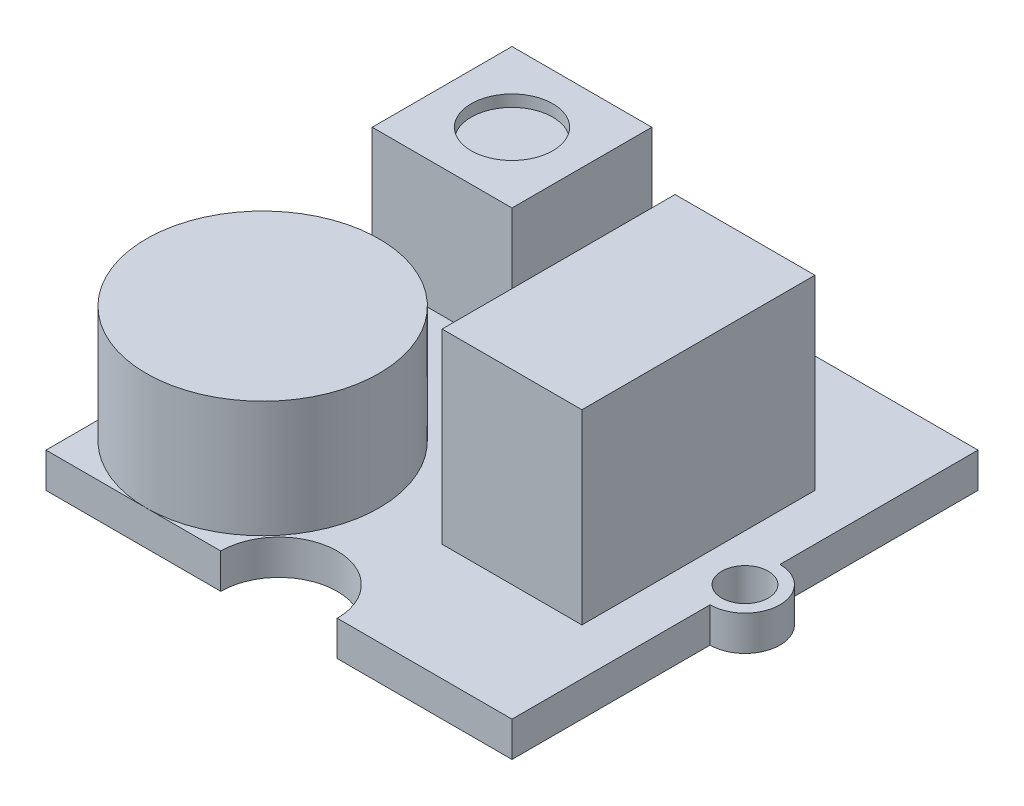
ISO-10303-21;
HEADER;
FILE_DESCRIPTION(('STEP AP214'),'2;1');
FILE_NAME('part.step','',(''),(''),'','','');
FILE_SCHEMA(('AUTOMOTIVE_DESIGN { 1 0 10303 214 1 1 1 1 }'));
ENDSEC;
DATA;
#1=APPLICATION_CONTEXT('core data for automotive mechanical design processes');
#2=APPLICATION_PROTOCOL_DEFINITION('international standard','automotive_design',2000,#1);
#3=PRODUCT_CONTEXT('',#1,'mechanical');
#4=PRODUCT('Part','Part','',(#3));
#5=PRODUCT_RELATED_PRODUCT_CATEGORY('part','',(#4));
#6=PRODUCT_DEFINITION_FORMATION('','',#4);
#7=PRODUCT_DEFINITION_CONTEXT('part definition',#1,'design');
#8=PRODUCT_DEFINITION('design','',#6,#7);
#9=PRODUCT_DEFINITION_SHAPE('','',#8);
#10=(LENGTH_UNIT() NAMED_UNIT(*) SI_UNIT(.MILLI.,.METRE.));
#11=(NAMED_UNIT(*) PLANE_ANGLE_UNIT() SI_UNIT($,.RADIAN.));
#12=(NAMED_UNIT(*) SI_UNIT($,.STERADIAN.) SOLID_ANGLE_UNIT());
#13=UNCERTAINTY_MEASURE_WITH_UNIT(LENGTH_MEASURE(1.E-05),#10,'distance_accuracy_value','');
#14=(GEOMETRIC_REPRESENTATION_CONTEXT(3) GLOBAL_UNCERTAINTY_ASSIGNED_CONTEXT((#13)) GLOBAL_UNIT_ASSIGNED_CONTEXT((#10,
#11,#12)) REPRESENTATION_CONTEXT('',''));
#15=CARTESIAN_POINT('',(0.,0.,0.));
#16=DIRECTION('',(0.,0.,1.));
#17=DIRECTION('',(1.,0.,0.));
#18=AXIS2_PLACEMENT_3D('',#15,#16,#17);
#19=CARTESIAN_POINT('',(0.,1.5,0.));
#20=DIRECTION('',(0.,1.,0.));
#21=DIRECTION('',(0.,0.,1.));
#22=AXIS2_PLACEMENT_3D('',#19,#20,#21);
#23=PLANE('',#22);
#24=CARTESIAN_POINT('',(-5.7,1.5,5.));
#25=DIRECTION('',(0.,1.,0.));
#26=DIRECTION('',(0.,0.,1.));
#27=AXIS2_PLACEMENT_3D('',#24,#25,#26);
#28=CIRCLE('',#27,5.);
#29=CARTESIAN_POINT('',(-5.7,1.5,10.));
#30=VERTEX_POINT('',#29);
#31=CARTESIAN_POINT('',(-10.,1.5,2.44852983556538));
#32=VERTEX_POINT('',#31);
#33=EDGE_CURVE('E44',#30,#32,#28,.T.);
#34=ORIENTED_EDGE('',*,*,#33,.F.);
#35=DIRECTION('',(1.,0.,0.));
#36=VECTOR('',#35,1.);
#37=CARTESIAN_POINT('',(-10.,1.5,10.));
#38=LINE('',#37,#36);
#39=CARTESIAN_POINT('',(-2.5,1.5,10.));
#40=VERTEX_POINT('',#39);
#41=EDGE_CURVE('E367',#30,#40,#38,.T.);
#42=ORIENTED_EDGE('',*,*,#41,.T.);
#43=CARTESIAN_POINT('',(0.,1.5,10.));
#44=DIRECTION('',(0.,1.,0.));
#45=DIRECTION('',(0.,0.,1.));
#46=AXIS2_PLACEMENT_3D('',#43,#44,#45);
#47=CIRCLE('',#46,2.5);
#48=CARTESIAN_POINT('',(2.5,1.5,10.));
#49=VERTEX_POINT('',#48);
#50=EDGE_CURVE('E295',#49,#40,#47,.T.);
#51=ORIENTED_EDGE('',*,*,#50,.F.);
#52=CARTESIAN_POINT('',(10.,1.5,10.));
#53=VERTEX_POINT('',#52);
#54=EDGE_CURVE('E362',#49,#53,#38,.T.);
#55=ORIENTED_EDGE('',*,*,#54,.T.);
#56=DIRECTION('',(0.,0.,-1.));
#57=VECTOR('',#56,1.);
#58=CARTESIAN_POINT('',(10.,1.5,-10.));
#59=LINE('',#58,#57);
#60=CARTESIAN_POINT('',(10.,1.5,1.5));
#61=VERTEX_POINT('',#60);
#62=EDGE_CURVE('E350',#53,#61,#59,.T.);
#63=ORIENTED_EDGE('',*,*,#62,.T.);
#64=CARTESIAN_POINT('',(10.,1.5,0.));
#65=DIRECTION('',(0.,1.,0.));
#66=DIRECTION('',(0.,0.,1.));
#67=AXIS2_PLACEMENT_3D('',#64,#65,#66);
#68=CIRCLE('',#67,1.5);
#69=CARTESIAN_POINT('',(10.,1.5,-1.5));
#70=VERTEX_POINT('',#69);
#71=EDGE_CURVE('E327',#61,#70,#68,.T.);
#72=ORIENTED_EDGE('',*,*,#71,.T.);
#73=CARTESIAN_POINT('',(10.,1.5,-10.));
#74=VERTEX_POINT('',#73);
#75=EDGE_CURVE('E354',#70,#74,#59,.T.);
#76=ORIENTED_EDGE('',*,*,#75,.T.);
#77=DIRECTION('',(-1.,0.,0.));
#78=VECTOR('',#77,1.);
#79=CARTESIAN_POINT('',(-10.,1.5,-10.));
#80=LINE('',#79,#78);
#81=CARTESIAN_POINT('',(2.5,1.5,-10.));
#82=VERTEX_POINT('',#81);
#83=EDGE_CURVE('E355',#74,#82,#80,.T.);
#84=ORIENTED_EDGE('',*,*,#83,.T.);
#85=CARTESIAN_POINT('',(0.,1.5,-10.));
#86=DIRECTION('',(0.,1.,0.));
#87=DIRECTION('',(0.,0.,1.));
#88=AXIS2_PLACEMENT_3D('',#85,#86,#87);
#89=CIRCLE('',#88,2.5);
#90=CARTESIAN_POINT('',(-2.5,1.5,-10.));
#91=VERTEX_POINT('',#90);
#92=EDGE_CURVE('E309',#91,#82,#89,.T.);
#93=ORIENTED_EDGE('',*,*,#92,.F.);
#94=CARTESIAN_POINT('',(-10.,1.5,-10.));
#95=VERTEX_POINT('',#94);
#96=EDGE_CURVE('E353',#91,#95,#80,.T.);
#97=ORIENTED_EDGE('',*,*,#96,.T.);
#98=DIRECTION('',(0.,0.,1.));
#99=VECTOR('',#98,1.);
#100=CARTESIAN_POINT('',(-10.,1.5,-10.));
#101=LINE('',#100,#99);
#102=CARTESIAN_POINT('',(-10.,1.5,-1.5));
#103=VERTEX_POINT('',#102);
#104=EDGE_CURVE('E359',#95,#103,#101,.T.);
#105=ORIENTED_EDGE('',*,*,#104,.T.);
#106=CARTESIAN_POINT('',(-10.,1.5,0.));
#107=DIRECTION('',(0.,1.,0.));
#108=DIRECTION('',(0.,0.,1.));
#109=AXIS2_PLACEMENT_3D('',#106,#107,#108);
#110=CIRCLE('',#109,1.5);
#111=CARTESIAN_POINT('',(-10.,1.5,1.5));
#112=VERTEX_POINT('',#111);
#113=EDGE_CURVE('E339',#103,#112,#110,.T.);
#114=ORIENTED_EDGE('',*,*,#113,.T.);
#115=EDGE_CURVE('E363',#112,#32,#101,.T.);
#116=ORIENTED_EDGE('',*,*,#115,.T.);
#117=EDGE_LOOP('',(#34,#42,#51,#55,#63,#72,#76,#84,#93,#97,#105,#114,#116));
#118=FACE_BOUND('',#117,.T.);
#119=CARTESIAN_POINT('',(10.,1.5,0.));
#120=DIRECTION('',(0.,1.,0.));
#121=DIRECTION('',(0.,0.,1.));
#122=AXIS2_PLACEMENT_3D('',#119,#120,#121);
#123=CIRCLE('',#122,1.);
#124=CARTESIAN_POINT('',(10.,1.5,1.));
#125=VERTEX_POINT('',#124);
#126=EDGE_CURVE('E317',#125,#125,#123,.T.);
#127=ORIENTED_EDGE('',*,*,#126,.F.);
#128=EDGE_LOOP('',(#127));
#129=FACE_BOUND('',#128,.T.);
#130=CARTESIAN_POINT('',(-10.,1.5,0.));
#131=DIRECTION('',(0.,1.,0.));
#132=DIRECTION('',(0.,0.,1.));
#133=AXIS2_PLACEMENT_3D('',#130,#131,#132);
#134=CIRCLE('',#133,1.);
#135=CARTESIAN_POINT('',(-10.,1.5,1.));
#136=VERTEX_POINT('',#135);
#137=EDGE_CURVE('E321',#136,#136,#134,.T.);
#138=ORIENTED_EDGE('',*,*,#137,.F.);
#139=EDGE_LOOP('',(#138));
#140=FACE_BOUND('',#139,.T.);
#141=DIRECTION('',(-1.,0.,0.));
#142=VECTOR('',#141,1.);
#143=CARTESIAN_POINT('',(-9.5,1.5,-9.5));
#144=LINE('',#143,#142);
#145=CARTESIAN_POINT('',(-3.5,1.5,-9.5));
#146=VERTEX_POINT('',#145);
#147=CARTESIAN_POINT('',(-9.5,1.5,-9.5));
#148=VERTEX_POINT('',#147);
#149=EDGE_CURVE('E278',#146,#148,#144,.T.);
#150=ORIENTED_EDGE('',*,*,#149,.F.);
#151=DIRECTION('',(0.,0.,-1.));
#152=VECTOR('',#151,1.);
#153=CARTESIAN_POINT('',(-3.5,1.5,-9.5));
#154=LINE('',#153,#152);
#155=CARTESIAN_POINT('',(-3.5,1.5,-3.5));
#156=VERTEX_POINT('',#155);
#157=EDGE_CURVE('E264',#156,#146,#154,.T.);
#158=ORIENTED_EDGE('',*,*,#157,.F.);
#159=DIRECTION('',(1.,0.,0.));
#160=VECTOR('',#159,1.);
#161=CARTESIAN_POINT('',(-9.5,1.5,-3.5));
#162=LINE('',#161,#160);
#163=CARTESIAN_POINT('',(-9.5,1.5,-3.5));
#164=VERTEX_POINT('',#163);
#165=EDGE_CURVE('E269',#164,#156,#162,.T.);
#166=ORIENTED_EDGE('',*,*,#165,.F.);
#167=DIRECTION('',(0.,0.,1.));
#168=VECTOR('',#167,1.);
#169=CARTESIAN_POINT('',(-9.5,1.5,-9.5));
#170=LINE('',#169,#168);
#171=EDGE_CURVE('E280',#148,#164,#170,.T.);
#172=ORIENTED_EDGE('',*,*,#171,.F.);
#173=EDGE_LOOP('',(#150,#158,#166,#172));
#174=FACE_BOUND('',#173,.T.);
#175=DIRECTION('',(-1.,0.,0.));
#176=VECTOR('',#175,1.);
#177=CARTESIAN_POINT('',(2.,1.5,-5.));
#178=LINE('',#177,#176);
#179=CARTESIAN_POINT('',(8.,1.5,-5.));
#180=VERTEX_POINT('',#179);
#181=CARTESIAN_POINT('',(2.,1.5,-5.));
#182=VERTEX_POINT('',#181);
#183=EDGE_CURVE('E236',#180,#182,#178,.T.);
#184=ORIENTED_EDGE('',*,*,#183,.F.);
#185=DIRECTION('',(0.,0.,-1.));
#186=VECTOR('',#185,1.);
#187=CARTESIAN_POINT('',(8.,1.5,-5.));
#188=LINE('',#187,#186);
#189=CARTESIAN_POINT('',(8.,1.5,5.));
#190=VERTEX_POINT('',#189);
#191=EDGE_CURVE('E233',#190,#180,#188,.T.);
#192=ORIENTED_EDGE('',*,*,#191,.F.);
#193=DIRECTION('',(1.,0.,0.));
#194=VECTOR('',#193,1.);
#195=CARTESIAN_POINT('',(2.,1.5,5.));
#196=LINE('',#195,#194);
#197=CARTESIAN_POINT('',(2.,1.5,5.));
#198=VERTEX_POINT('',#197);
#199=EDGE_CURVE('E245',#198,#190,#196,.T.);
#200=ORIENTED_EDGE('',*,*,#199,.F.);
#201=DIRECTION('',(0.,0.,1.));
#202=VECTOR('',#201,1.);
#203=CARTESIAN_POINT('',(2.,1.5,-5.));
#204=LINE('',#203,#202);
#205=EDGE_CURVE('E253',#182,#198,#204,.T.);
#206=ORIENTED_EDGE('',*,*,#205,.F.);
#207=EDGE_LOOP('',(#184,#192,#200,#206));
#208=FACE_BOUND('',#207,.T.);
#209=DIRECTION('',(-1.,0.,0.));
#210=VECTOR('',#209,1.);
#211=CARTESIAN_POINT('',(-2.,1.5,-5.20298131056688));
#212=LINE('',#211,#210);
#213=CARTESIAN_POINT('',(0.999999999999998,1.5,-5.20298131056688));
#214=VERTEX_POINT('',#213);
#215=CARTESIAN_POINT('',(-2.,1.5,-5.20298131056688));
#216=VERTEX_POINT('',#215);
#217=EDGE_CURVE('E508',#214,#216,#212,.T.);
#218=ORIENTED_EDGE('',*,*,#217,.F.);
#219=DIRECTION('',(0.,0.,-1.));
#220=VECTOR('',#219,1.);
#221=CARTESIAN_POINT('',(0.999999999999998,1.5,-5.20298131056688));
#222=LINE('',#221,#220);
#223=CARTESIAN_POINT('',(0.999999999999999,1.5,-3.38292701181344));
#224=VERTEX_POINT('',#223);
#225=EDGE_CURVE('E231',#224,#214,#222,.T.);
#226=ORIENTED_EDGE('',*,*,#225,.F.);
#227=DIRECTION('',(1.,0.,0.));
#228=VECTOR('',#227,1.);
#229=CARTESIAN_POINT('',(-2.,1.5,-3.38292701181344));
#230=LINE('',#229,#228);
#231=CARTESIAN_POINT('',(-2.,1.5,-3.38292701181344));
#232=VERTEX_POINT('',#231);
#233=EDGE_CURVE('E227',#232,#224,#230,.T.);
#234=ORIENTED_EDGE('',*,*,#233,.F.);
#235=DIRECTION('',(0.,0.,1.));
#236=VECTOR('',#235,1.);
#237=CARTESIAN_POINT('',(-2.,1.5,-5.20298131056688));
#238=LINE('',#237,#236);
#239=EDGE_CURVE('E510',#216,#232,#238,.T.);
#240=ORIENTED_EDGE('',*,*,#239,.F.);
#241=EDGE_LOOP('',(#218,#226,#234,#240));
#242=FACE_BOUND('',#241,.T.);
#243=ADVANCED_FACE('F34',(#118,#129,#140,#174,#208,#242),#23,.T.);
#244=CARTESIAN_POINT('',(-10.,1.5,10.));
#245=DIRECTION('',(0.,0.,-1.));
#246=DIRECTION('',(-1.,0.,0.));
#247=AXIS2_PLACEMENT_3D('',#244,#245,#246);
#248=PLANE('',#247);
#249=DIRECTION('',(1.,0.,0.));
#250=VECTOR('',#249,1.);
#251=CARTESIAN_POINT('',(-10.,0.,10.));
#252=LINE('',#251,#250);
#253=CARTESIAN_POINT('',(-10.,0.,10.));
#254=VERTEX_POINT('',#253);
#255=CARTESIAN_POINT('',(-2.5,0.,10.));
#256=VERTEX_POINT('',#255);
#257=EDGE_CURVE('E380',#254,#256,#252,.T.);
#258=ORIENTED_EDGE('',*,*,#257,.T.);
#259=DIRECTION('',(0.,1.,0.));
#260=VECTOR('',#259,1.);
#261=CARTESIAN_POINT('',(-2.5,0.,10.));
#262=LINE('',#261,#260);
#263=EDGE_CURVE('E306',#256,#40,#262,.T.);
#264=ORIENTED_EDGE('',*,*,#263,.T.);
#265=ORIENTED_EDGE('',*,*,#41,.F.);
#266=CARTESIAN_POINT('',(-10.,1.5,10.));
#267=VERTEX_POINT('',#266);
#268=EDGE_CURVE('E364',#267,#30,#38,.T.);
#269=ORIENTED_EDGE('',*,*,#268,.F.);
#270=DIRECTION('',(0.,-1.,0.));
#271=VECTOR('',#270,1.);
#272=CARTESIAN_POINT('',(-10.,1.5,10.));
#273=LINE('',#272,#271);
#274=EDGE_CURVE('E385',#267,#254,#273,.T.);
#275=ORIENTED_EDGE('',*,*,#274,.T.);
#276=EDGE_LOOP('',(#258,#264,#265,#269,#275));
#277=FACE_BOUND('',#276,.T.);
#278=ADVANCED_FACE('F427',(#277),#248,.F.);
#279=CARTESIAN_POINT('',(-10.,1.5,-10.));
#280=DIRECTION('',(0.,0.,1.));
#281=DIRECTION('',(1.,0.,0.));
#282=AXIS2_PLACEMENT_3D('',#279,#280,#281);
#283=PLANE('',#282);
#284=DIRECTION('',(-1.,0.,0.));
#285=VECTOR('',#284,1.);
#286=CARTESIAN_POINT('',(-10.,0.,-10.));
#287=LINE('',#286,#285);
#288=CARTESIAN_POINT('',(10.,0.,-10.));
#289=VERTEX_POINT('',#288);
#290=CARTESIAN_POINT('',(2.5,0.,-10.));
#291=VERTEX_POINT('',#290);
#292=EDGE_CURVE('E372',#289,#291,#287,.T.);
#293=ORIENTED_EDGE('',*,*,#292,.T.);
#294=DIRECTION('',(0.,1.,0.));
#295=VECTOR('',#294,1.);
#296=CARTESIAN_POINT('',(2.5,0.,-10.));
#297=LINE('',#296,#295);
#298=EDGE_CURVE('E314',#291,#82,#297,.T.);
#299=ORIENTED_EDGE('',*,*,#298,.T.);
#300=ORIENTED_EDGE('',*,*,#83,.F.);
#301=DIRECTION('',(0.,-1.,0.));
#302=VECTOR('',#301,1.);
#303=CARTESIAN_POINT('',(10.,1.5,-10.));
#304=LINE('',#303,#302);
#305=EDGE_CURVE('E390',#74,#289,#304,.T.);
#306=ORIENTED_EDGE('',*,*,#305,.T.);
#307=EDGE_LOOP('',(#293,#299,#300,#306));
#308=FACE_BOUND('',#307,.T.);
#309=ADVANCED_FACE('F404',(#308),#283,.F.);
#310=CARTESIAN_POINT('',(10.,1.5,-10.));
#311=DIRECTION('',(-1.,0.,0.));
#312=DIRECTION('',(0.,0.,1.));
#313=AXIS2_PLACEMENT_3D('',#310,#311,#312);
#314=PLANE('',#313);
#315=DIRECTION('',(0.,0.,-1.));
#316=VECTOR('',#315,1.);
#317=CARTESIAN_POINT('',(10.,0.,-10.));
#318=LINE('',#317,#316);
#319=CARTESIAN_POINT('',(10.,0.,10.));
#320=VERTEX_POINT('',#319);
#321=CARTESIAN_POINT('',(10.,0.,1.5));
#322=VERTEX_POINT('',#321);
#323=EDGE_CURVE('E368',#320,#322,#318,.T.);
#324=ORIENTED_EDGE('',*,*,#323,.T.);
#325=DIRECTION('',(0.,1.,0.));
#326=VECTOR('',#325,1.);
#327=CARTESIAN_POINT('',(10.,0.,1.5));
#328=LINE('',#327,#326);
#329=EDGE_CURVE('E336',#322,#61,#328,.T.);
#330=ORIENTED_EDGE('',*,*,#329,.T.);
#331=ORIENTED_EDGE('',*,*,#62,.F.);
#332=DIRECTION('',(0.,-1.,0.));
#333=VECTOR('',#332,1.);
#334=CARTESIAN_POINT('',(10.,1.5,10.));
#335=LINE('',#334,#333);
#336=EDGE_CURVE('E366',#53,#320,#335,.T.);
#337=ORIENTED_EDGE('',*,*,#336,.T.);
#338=EDGE_LOOP('',(#324,#330,#331,#337));
#339=FACE_BOUND('',#338,.T.);
#340=ADVANCED_FACE('F417',(#339),#314,.F.);
#341=CARTESIAN_POINT('',(-10.,1.5,-10.));
#342=DIRECTION('',(1.,0.,0.));
#343=DIRECTION('',(0.,0.,-1.));
#344=AXIS2_PLACEMENT_3D('',#341,#342,#343);
#345=PLANE('',#344);
#346=DIRECTION('',(0.,0.,1.));
#347=VECTOR('',#346,1.);
#348=CARTESIAN_POINT('',(-10.,0.,-10.));
#349=LINE('',#348,#347);
#350=CARTESIAN_POINT('',(-10.,0.,-10.));
#351=VERTEX_POINT('',#350);
#352=CARTESIAN_POINT('',(-10.,0.,-1.5));
#353=VERTEX_POINT('',#352);
#354=EDGE_CURVE('E376',#351,#353,#349,.T.);
#355=ORIENTED_EDGE('',*,*,#354,.T.);
#356=DIRECTION('',(0.,1.,0.));
#357=VECTOR('',#356,1.);
#358=CARTESIAN_POINT('',(-10.,0.,-1.5));
#359=LINE('',#358,#357);
#360=EDGE_CURVE('E346',#353,#103,#359,.T.);
#361=ORIENTED_EDGE('',*,*,#360,.T.);
#362=ORIENTED_EDGE('',*,*,#104,.F.);
#363=DIRECTION('',(0.,-1.,0.));
#364=VECTOR('',#363,1.);
#365=CARTESIAN_POINT('',(-10.,1.5,-10.));
#366=LINE('',#365,#364);
#367=EDGE_CURVE('E388',#95,#351,#366,.T.);
#368=ORIENTED_EDGE('',*,*,#367,.T.);
#369=EDGE_LOOP('',(#355,#361,#362,#368));
#370=FACE_BOUND('',#369,.T.);
#371=ADVANCED_FACE('F440',(#370),#345,.F.);
#372=ORIENTED_EDGE('',*,*,#75,.F.);
#373=DIRECTION('',(0.,1.,0.));
#374=VECTOR('',#373,1.);
#375=CARTESIAN_POINT('',(10.,0.,-1.5));
#376=LINE('',#375,#374);
#377=CARTESIAN_POINT('',(10.,0.,-1.5));
#378=VERTEX_POINT('',#377);
#379=EDGE_CURVE('E332',#70,#378,#376,.F.);
#380=ORIENTED_EDGE('',*,*,#379,.T.);
#381=EDGE_CURVE('E349',#378,#289,#318,.T.);
#382=ORIENTED_EDGE('',*,*,#381,.T.);
#383=ORIENTED_EDGE('',*,*,#305,.F.);
#384=EDGE_LOOP('',(#372,#380,#382,#383));
#385=FACE_BOUND('',#384,.T.);
#386=ADVANCED_FACE('F36',(#385),#314,.F.);
#387=ORIENTED_EDGE('',*,*,#96,.F.);
#388=DIRECTION('',(0.,1.,0.));
#389=VECTOR('',#388,1.);
#390=CARTESIAN_POINT('',(-2.5,0.,-10.));
#391=LINE('',#390,#389);
#392=CARTESIAN_POINT('',(-2.5,0.,-10.));
#393=VERTEX_POINT('',#392);
#394=EDGE_CURVE('E311',#91,#393,#391,.F.);
#395=ORIENTED_EDGE('',*,*,#394,.T.);
#396=EDGE_CURVE('E371',#393,#351,#287,.T.);
#397=ORIENTED_EDGE('',*,*,#396,.T.);
#398=ORIENTED_EDGE('',*,*,#367,.F.);
#399=EDGE_LOOP('',(#387,#395,#397,#398));
#400=FACE_BOUND('',#399,.T.);
#401=ADVANCED_FACE('F444',(#400),#283,.F.);
#402=ORIENTED_EDGE('',*,*,#115,.F.);
#403=DIRECTION('',(0.,1.,0.));
#404=VECTOR('',#403,1.);
#405=CARTESIAN_POINT('',(-10.,0.,1.5));
#406=LINE('',#405,#404);
#407=CARTESIAN_POINT('',(-10.,0.,1.5));
#408=VERTEX_POINT('',#407);
#409=EDGE_CURVE('E342',#112,#408,#406,.F.);
#410=ORIENTED_EDGE('',*,*,#409,.T.);
#411=EDGE_CURVE('E375',#408,#254,#349,.T.);
#412=ORIENTED_EDGE('',*,*,#411,.T.);
#413=ORIENTED_EDGE('',*,*,#274,.F.);
#414=CARTESIAN_POINT('',(-10.,1.5,7.55147016443462));
#415=VERTEX_POINT('',#414);
#416=EDGE_CURVE('E358',#415,#267,#101,.T.);
#417=ORIENTED_EDGE('',*,*,#416,.F.);
#418=EDGE_CURVE('E481',#32,#415,#101,.T.);
#419=ORIENTED_EDGE('',*,*,#418,.F.);
#420=EDGE_LOOP('',(#402,#410,#412,#413,#417,#419));
#421=FACE_BOUND('',#420,.T.);
#422=ADVANCED_FACE('F434',(#421),#345,.F.);
#423=ORIENTED_EDGE('',*,*,#54,.F.);
#424=DIRECTION('',(0.,1.,0.));
#425=VECTOR('',#424,1.);
#426=CARTESIAN_POINT('',(2.5,0.,10.));
#427=LINE('',#426,#425);
#428=CARTESIAN_POINT('',(2.5,0.,10.));
#429=VERTEX_POINT('',#428);
#430=EDGE_CURVE('E301',#49,#429,#427,.F.);
#431=ORIENTED_EDGE('',*,*,#430,.T.);
#432=EDGE_CURVE('E379',#429,#320,#252,.T.);
#433=ORIENTED_EDGE('',*,*,#432,.T.);
#434=ORIENTED_EDGE('',*,*,#336,.F.);
#435=EDGE_LOOP('',(#423,#431,#433,#434));
#436=FACE_BOUND('',#435,.T.);
#437=ADVANCED_FACE('F422',(#436),#248,.F.);
#438=EDGE_CURVE('E11',#415,#30,#28,.T.);
#439=ORIENTED_EDGE('',*,*,#438,.F.);
#440=ORIENTED_EDGE('',*,*,#416,.T.);
#441=ORIENTED_EDGE('',*,*,#268,.T.);
#442=EDGE_LOOP('',(#439,#440,#441));
#443=FACE_BOUND('',#442,.T.);
#444=ADVANCED_FACE('F461',(#443),#23,.T.);
#445=CARTESIAN_POINT('',(0.,0.,0.));
#446=DIRECTION('',(0.,1.,0.));
#447=DIRECTION('',(0.,0.,1.));
#448=AXIS2_PLACEMENT_3D('',#445,#446,#447);
#449=PLANE('',#448);
#450=CARTESIAN_POINT('',(10.,0.,0.));
#451=DIRECTION('',(0.,1.,0.));
#452=DIRECTION('',(0.,0.,1.));
#453=AXIS2_PLACEMENT_3D('',#450,#451,#452);
#454=CIRCLE('',#453,1.);
#455=CARTESIAN_POINT('',(10.,0.,1.));
#456=VERTEX_POINT('',#455);
#457=EDGE_CURVE('E318',#456,#456,#454,.T.);
#458=ORIENTED_EDGE('',*,*,#457,.T.);
#459=EDGE_LOOP('',(#458));
#460=FACE_BOUND('',#459,.T.);
#461=CARTESIAN_POINT('',(-10.,0.,0.));
#462=DIRECTION('',(0.,1.,0.));
#463=DIRECTION('',(0.,0.,1.));
#464=AXIS2_PLACEMENT_3D('',#461,#462,#463);
#465=CIRCLE('',#464,1.);
#466=CARTESIAN_POINT('',(-10.,0.,1.));
#467=VERTEX_POINT('',#466);
#468=EDGE_CURVE('E324',#467,#467,#465,.T.);
#469=ORIENTED_EDGE('',*,*,#468,.T.);
#470=EDGE_LOOP('',(#469));
#471=FACE_BOUND('',#470,.T.);
#472=ORIENTED_EDGE('',*,*,#432,.F.);
#473=CARTESIAN_POINT('',(0.,0.,10.));
#474=DIRECTION('',(0.,1.,0.));
#475=DIRECTION('',(0.,0.,1.));
#476=AXIS2_PLACEMENT_3D('',#473,#474,#475);
#477=CIRCLE('',#476,2.5);
#478=EDGE_CURVE('E298',#429,#256,#477,.T.);
#479=ORIENTED_EDGE('',*,*,#478,.T.);
#480=ORIENTED_EDGE('',*,*,#257,.F.);
#481=ORIENTED_EDGE('',*,*,#411,.F.);
#482=CARTESIAN_POINT('',(-10.,0.,0.));
#483=DIRECTION('',(0.,1.,0.));
#484=DIRECTION('',(0.,0.,1.));
#485=AXIS2_PLACEMENT_3D('',#482,#483,#484);
#486=CIRCLE('',#485,1.5);
#487=EDGE_CURVE('E340',#353,#408,#486,.T.);
#488=ORIENTED_EDGE('',*,*,#487,.F.);
#489=ORIENTED_EDGE('',*,*,#354,.F.);
#490=ORIENTED_EDGE('',*,*,#396,.F.);
#491=CARTESIAN_POINT('',(0.,0.,-10.));
#492=DIRECTION('',(0.,1.,0.));
#493=DIRECTION('',(0.,0.,1.));
#494=AXIS2_PLACEMENT_3D('',#491,#492,#493);
#495=CIRCLE('',#494,2.5);
#496=EDGE_CURVE('E38',#393,#291,#495,.T.);
#497=ORIENTED_EDGE('',*,*,#496,.T.);
#498=ORIENTED_EDGE('',*,*,#292,.F.);
#499=ORIENTED_EDGE('',*,*,#381,.F.);
#500=CARTESIAN_POINT('',(10.,0.,0.));
#501=DIRECTION('',(0.,1.,0.));
#502=DIRECTION('',(0.,0.,1.));
#503=AXIS2_PLACEMENT_3D('',#500,#501,#502);
#504=CIRCLE('',#503,1.5);
#505=EDGE_CURVE('E330',#322,#378,#504,.T.);
#506=ORIENTED_EDGE('',*,*,#505,.F.);
#507=ORIENTED_EDGE('',*,*,#323,.F.);
#508=EDGE_LOOP('',(#472,#479,#480,#481,#488,#489,#490,#497,#498,#499,#506,#507));
#509=FACE_BOUND('',#508,.T.);
#510=ADVANCED_FACE('F400',(#460,#471,#509),#449,.F.);
#511=CARTESIAN_POINT('',(-10.,0.,0.));
#512=DIRECTION('',(0.,1.,0.));
#513=DIRECTION('',(0.,0.,1.));
#514=AXIS2_PLACEMENT_3D('',#511,#512,#513);
#515=CYLINDRICAL_SURFACE('',#514,1.5);
#516=ORIENTED_EDGE('',*,*,#360,.F.);
#517=ORIENTED_EDGE('',*,*,#487,.T.);
#518=ORIENTED_EDGE('',*,*,#409,.F.);
#519=ORIENTED_EDGE('',*,*,#113,.F.);
#520=EDGE_LOOP('',(#516,#517,#518,#519));
#521=FACE_BOUND('',#520,.T.);
#522=ADVANCED_FACE('F474',(#521),#515,.T.);
#523=CARTESIAN_POINT('',(10.,0.,0.));
#524=DIRECTION('',(0.,1.,0.));
#525=DIRECTION('',(0.,0.,1.));
#526=AXIS2_PLACEMENT_3D('',#523,#524,#525);
#527=CYLINDRICAL_SURFACE('',#526,1.5);
#528=ORIENTED_EDGE('',*,*,#329,.F.);
#529=ORIENTED_EDGE('',*,*,#505,.T.);
#530=ORIENTED_EDGE('',*,*,#379,.F.);
#531=ORIENTED_EDGE('',*,*,#71,.F.);
#532=EDGE_LOOP('',(#528,#529,#530,#531));
#533=FACE_BOUND('',#532,.T.);
#534=ADVANCED_FACE('F484',(#533),#527,.T.);
#535=CARTESIAN_POINT('',(-10.,0.,0.));
#536=DIRECTION('',(0.,1.,0.));
#537=DIRECTION('',(0.,0.,1.));
#538=AXIS2_PLACEMENT_3D('',#535,#536,#537);
#539=CYLINDRICAL_SURFACE('',#538,1.);
#540=ORIENTED_EDGE('',*,*,#468,.F.);
#541=EDGE_LOOP('',(#540));
#542=FACE_BOUND('',#541,.T.);
#543=ORIENTED_EDGE('',*,*,#137,.T.);
#544=EDGE_LOOP('',(#543));
#545=FACE_BOUND('',#544,.T.);
#546=ADVANCED_FACE('F456',(#542,#545),#539,.F.);
#547=CARTESIAN_POINT('',(10.,0.,0.));
#548=DIRECTION('',(0.,1.,0.));
#549=DIRECTION('',(0.,0.,1.));
#550=AXIS2_PLACEMENT_3D('',#547,#548,#549);
#551=CYLINDRICAL_SURFACE('',#550,1.);
#552=ORIENTED_EDGE('',*,*,#457,.F.);
#553=EDGE_LOOP('',(#552));
#554=FACE_BOUND('',#553,.T.);
#555=ORIENTED_EDGE('',*,*,#126,.T.);
#556=EDGE_LOOP('',(#555));
#557=FACE_BOUND('',#556,.T.);
#558=ADVANCED_FACE('F448',(#554,#557),#551,.F.);
#559=CARTESIAN_POINT('',(0.,0.,-10.));
#560=DIRECTION('',(0.,1.,0.));
#561=DIRECTION('',(0.,0.,1.));
#562=AXIS2_PLACEMENT_3D('',#559,#560,#561);
#563=CYLINDRICAL_SURFACE('',#562,2.5);
#564=ORIENTED_EDGE('',*,*,#496,.F.);
#565=ORIENTED_EDGE('',*,*,#394,.F.);
#566=ORIENTED_EDGE('',*,*,#92,.T.);
#567=ORIENTED_EDGE('',*,*,#298,.F.);
#568=EDGE_LOOP('',(#564,#565,#566,#567));
#569=FACE_BOUND('',#568,.T.);
#570=ADVANCED_FACE('F445',(#569),#563,.F.);
#571=CARTESIAN_POINT('',(0.,0.,10.));
#572=DIRECTION('',(0.,1.,0.));
#573=DIRECTION('',(0.,0.,1.));
#574=AXIS2_PLACEMENT_3D('',#571,#572,#573);
#575=CYLINDRICAL_SURFACE('',#574,2.5);
#576=ORIENTED_EDGE('',*,*,#478,.F.);
#577=ORIENTED_EDGE('',*,*,#430,.F.);
#578=ORIENTED_EDGE('',*,*,#50,.T.);
#579=ORIENTED_EDGE('',*,*,#263,.F.);
#580=EDGE_LOOP('',(#576,#577,#578,#579));
#581=FACE_BOUND('',#580,.T.);
#582=ADVANCED_FACE('F447',(#581),#575,.F.);
#583=CARTESIAN_POINT('',(-5.7,1.5,5.));
#584=DIRECTION('',(0.,1.,0.));
#585=DIRECTION('',(0.,0.,1.));
#586=AXIS2_PLACEMENT_3D('',#583,#584,#585);
#587=PLANE('',#586);
#588=EDGE_CURVE('E45',#32,#415,#28,.T.);
#589=ORIENTED_EDGE('',*,*,#588,.F.);
#590=ORIENTED_EDGE('',*,*,#418,.T.);
#591=EDGE_LOOP('',(#589,#590));
#592=FACE_BOUND('',#591,.T.);
#593=ADVANCED_FACE('F454',(#592),#587,.F.);
#594=CARTESIAN_POINT('',(-5.7,6.5,5.));
#595=DIRECTION('',(0.,-1.,0.));
#596=DIRECTION('',(0.,0.,-1.));
#597=AXIS2_PLACEMENT_3D('',#594,#595,#596);
#598=CYLINDRICAL_SURFACE('',#597,5.);
#599=CARTESIAN_POINT('',(-5.7,6.5,5.));
#600=DIRECTION('',(0.,1.,0.));
#601=DIRECTION('',(0.,0.,1.));
#602=AXIS2_PLACEMENT_3D('',#599,#600,#601);
#603=CIRCLE('',#602,5.);
#604=CARTESIAN_POINT('',(-5.7,6.5,10.));
#605=VERTEX_POINT('',#604);
#606=EDGE_CURVE('E293',#605,#605,#603,.T.);
#607=ORIENTED_EDGE('',*,*,#606,.F.);
#608=EDGE_LOOP('',(#607));
#609=FACE_BOUND('',#608,.T.);
#610=ORIENTED_EDGE('',*,*,#33,.T.);
#611=ORIENTED_EDGE('',*,*,#588,.T.);
#612=ORIENTED_EDGE('',*,*,#438,.T.);
#613=EDGE_LOOP('',(#610,#611,#612));
#614=FACE_BOUND('',#613,.T.);
#615=ADVANCED_FACE('F478',(#609,#614),#598,.T.);
#616=CARTESIAN_POINT('',(-5.7,6.5,5.));
#617=DIRECTION('',(0.,1.,0.));
#618=DIRECTION('',(0.,0.,1.));
#619=AXIS2_PLACEMENT_3D('',#616,#617,#618);
#620=PLANE('',#619);
#621=ORIENTED_EDGE('',*,*,#606,.T.);
#622=EDGE_LOOP('',(#621));
#623=FACE_BOUND('',#622,.T.);
#624=ADVANCED_FACE('F568',(#623),#620,.T.);
#625=CARTESIAN_POINT('',(-3.5,7.,-9.5));
#626=DIRECTION('',(-1.,0.,0.));
#627=DIRECTION('',(0.,0.,1.));
#628=AXIS2_PLACEMENT_3D('',#625,#626,#627);
#629=PLANE('',#628);
#630=ORIENTED_EDGE('',*,*,#157,.T.);
#631=DIRECTION('',(0.,-1.,0.));
#632=VECTOR('',#631,1.);
#633=CARTESIAN_POINT('',(-3.5,7.,-9.5));
#634=LINE('',#633,#632);
#635=CARTESIAN_POINT('',(-3.5,7.,-9.5));
#636=VERTEX_POINT('',#635);
#637=EDGE_CURVE('E291',#636,#146,#634,.T.);
#638=ORIENTED_EDGE('',*,*,#637,.F.);
#639=DIRECTION('',(0.,0.,-1.));
#640=VECTOR('',#639,1.);
#641=CARTESIAN_POINT('',(-3.5,7.,-9.5));
#642=LINE('',#641,#640);
#643=CARTESIAN_POINT('',(-3.5,7.,-3.5));
#644=VERTEX_POINT('',#643);
#645=EDGE_CURVE('E265',#644,#636,#642,.T.);
#646=ORIENTED_EDGE('',*,*,#645,.F.);
#647=DIRECTION('',(0.,-1.,0.));
#648=VECTOR('',#647,1.);
#649=CARTESIAN_POINT('',(-3.5,7.,-3.5));
#650=LINE('',#649,#648);
#651=EDGE_CURVE('E275',#644,#156,#650,.T.);
#652=ORIENTED_EDGE('',*,*,#651,.T.);
#653=EDGE_LOOP('',(#630,#638,#646,#652));
#654=FACE_BOUND('',#653,.T.);
#655=ADVANCED_FACE('F547',(#654),#629,.F.);
#656=CARTESIAN_POINT('',(-9.5,7.,-9.5));
#657=DIRECTION('',(0.,0.,1.));
#658=DIRECTION('',(1.,0.,0.));
#659=AXIS2_PLACEMENT_3D('',#656,#657,#658);
#660=PLANE('',#659);
#661=ORIENTED_EDGE('',*,*,#149,.T.);
#662=DIRECTION('',(0.,-1.,0.));
#663=VECTOR('',#662,1.);
#664=CARTESIAN_POINT('',(-9.5,7.,-9.5));
#665=LINE('',#664,#663);
#666=CARTESIAN_POINT('',(-9.5,7.,-9.5));
#667=VERTEX_POINT('',#666);
#668=EDGE_CURVE('E288',#667,#148,#665,.T.);
#669=ORIENTED_EDGE('',*,*,#668,.F.);
#670=DIRECTION('',(-1.,0.,0.));
#671=VECTOR('',#670,1.);
#672=CARTESIAN_POINT('',(-9.5,7.,-9.5));
#673=LINE('',#672,#671);
#674=EDGE_CURVE('E268',#636,#667,#673,.T.);
#675=ORIENTED_EDGE('',*,*,#674,.F.);
#676=ORIENTED_EDGE('',*,*,#637,.T.);
#677=EDGE_LOOP('',(#661,#669,#675,#676));
#678=FACE_BOUND('',#677,.T.);
#679=ADVANCED_FACE('F549',(#678),#660,.F.);
#680=CARTESIAN_POINT('',(-9.5,7.,-9.5));
#681=DIRECTION('',(1.,0.,0.));
#682=DIRECTION('',(0.,0.,-1.));
#683=AXIS2_PLACEMENT_3D('',#680,#681,#682);
#684=PLANE('',#683);
#685=ORIENTED_EDGE('',*,*,#171,.T.);
#686=DIRECTION('',(0.,-1.,0.));
#687=VECTOR('',#686,1.);
#688=CARTESIAN_POINT('',(-9.5,7.,-3.5));
#689=LINE('',#688,#687);
#690=CARTESIAN_POINT('',(-9.5,7.,-3.5));
#691=VERTEX_POINT('',#690);
#692=EDGE_CURVE('E286',#691,#164,#689,.T.);
#693=ORIENTED_EDGE('',*,*,#692,.F.);
#694=DIRECTION('',(0.,0.,1.));
#695=VECTOR('',#694,1.);
#696=CARTESIAN_POINT('',(-9.5,7.,-9.5));
#697=LINE('',#696,#695);
#698=EDGE_CURVE('E271',#667,#691,#697,.T.);
#699=ORIENTED_EDGE('',*,*,#698,.F.);
#700=ORIENTED_EDGE('',*,*,#668,.T.);
#701=EDGE_LOOP('',(#685,#693,#699,#700));
#702=FACE_BOUND('',#701,.T.);
#703=ADVANCED_FACE('F553',(#702),#684,.F.);
#704=CARTESIAN_POINT('',(-9.5,7.,-3.5));
#705=DIRECTION('',(0.,0.,-1.));
#706=DIRECTION('',(-1.,0.,0.));
#707=AXIS2_PLACEMENT_3D('',#704,#705,#706);
#708=PLANE('',#707);
#709=ORIENTED_EDGE('',*,*,#165,.T.);
#710=ORIENTED_EDGE('',*,*,#651,.F.);
#711=DIRECTION('',(1.,0.,0.));
#712=VECTOR('',#711,1.);
#713=CARTESIAN_POINT('',(-9.5,7.,-3.5));
#714=LINE('',#713,#712);
#715=EDGE_CURVE('E273',#691,#644,#714,.T.);
#716=ORIENTED_EDGE('',*,*,#715,.F.);
#717=ORIENTED_EDGE('',*,*,#692,.T.);
#718=EDGE_LOOP('',(#709,#710,#716,#717));
#719=FACE_BOUND('',#718,.T.);
#720=ADVANCED_FACE('F539',(#719),#708,.F.);
#721=CARTESIAN_POINT('',(0.,7.,0.));
#722=DIRECTION('',(0.,1.,0.));
#723=DIRECTION('',(0.,0.,1.));
#724=AXIS2_PLACEMENT_3D('',#721,#722,#723);
#725=PLANE('',#724);
#726=CARTESIAN_POINT('',(-6.5,7.,-6.5));
#727=DIRECTION('',(0.,1.,0.));
#728=DIRECTION('',(0.,0.,1.));
#729=AXIS2_PLACEMENT_3D('',#726,#727,#728);
#730=CIRCLE('',#729,1.75);
#731=CARTESIAN_POINT('',(-6.5,7.,-4.75));
#732=VERTEX_POINT('',#731);
#733=EDGE_CURVE('E521',#732,#732,#730,.T.);
#734=ORIENTED_EDGE('',*,*,#733,.F.);
#735=EDGE_LOOP('',(#734));
#736=FACE_BOUND('',#735,.T.);
#737=ORIENTED_EDGE('',*,*,#645,.T.);
#738=ORIENTED_EDGE('',*,*,#674,.T.);
#739=ORIENTED_EDGE('',*,*,#698,.T.);
#740=ORIENTED_EDGE('',*,*,#715,.T.);
#741=EDGE_LOOP('',(#737,#738,#739,#740));
#742=FACE_BOUND('',#741,.T.);
#743=ADVANCED_FACE('F535',(#736,#742),#725,.T.);
#744=CARTESIAN_POINT('',(8.,9.5,-5.));
#745=DIRECTION('',(-1.,0.,0.));
#746=DIRECTION('',(0.,0.,1.));
#747=AXIS2_PLACEMENT_3D('',#744,#745,#746);
#748=PLANE('',#747);
#749=ORIENTED_EDGE('',*,*,#191,.T.);
#750=DIRECTION('',(0.,-1.,0.));
#751=VECTOR('',#750,1.);
#752=CARTESIAN_POINT('',(8.,9.5,-5.));
#753=LINE('',#752,#751);
#754=CARTESIAN_POINT('',(8.,9.5,-5.));
#755=VERTEX_POINT('',#754);
#756=EDGE_CURVE('E262',#755,#180,#753,.T.);
#757=ORIENTED_EDGE('',*,*,#756,.F.);
#758=DIRECTION('',(0.,0.,-1.));
#759=VECTOR('',#758,1.);
#760=CARTESIAN_POINT('',(8.,9.5,-5.));
#761=LINE('',#760,#759);
#762=CARTESIAN_POINT('',(8.,9.5,5.));
#763=VERTEX_POINT('',#762);
#764=EDGE_CURVE('E241',#763,#755,#761,.T.);
#765=ORIENTED_EDGE('',*,*,#764,.F.);
#766=DIRECTION('',(0.,-1.,0.));
#767=VECTOR('',#766,1.);
#768=CARTESIAN_POINT('',(8.,9.5,5.));
#769=LINE('',#768,#767);
#770=EDGE_CURVE('E250',#763,#190,#769,.T.);
#771=ORIENTED_EDGE('',*,*,#770,.T.);
#772=EDGE_LOOP('',(#749,#757,#765,#771));
#773=FACE_BOUND('',#772,.T.);
#774=ADVANCED_FACE('F538',(#773),#748,.F.);
#775=CARTESIAN_POINT('',(2.,9.5,-5.));
#776=DIRECTION('',(0.,0.,1.));
#777=DIRECTION('',(1.,0.,0.));
#778=AXIS2_PLACEMENT_3D('',#775,#776,#777);
#779=PLANE('',#778);
#780=ORIENTED_EDGE('',*,*,#183,.T.);
#781=DIRECTION('',(0.,-1.,0.));
#782=VECTOR('',#781,1.);
#783=CARTESIAN_POINT('',(2.,9.5,-5.));
#784=LINE('',#783,#782);
#785=CARTESIAN_POINT('',(2.,9.5,-5.));
#786=VERTEX_POINT('',#785);
#787=EDGE_CURVE('E259',#786,#182,#784,.T.);
#788=ORIENTED_EDGE('',*,*,#787,.F.);
#789=DIRECTION('',(-1.,0.,0.));
#790=VECTOR('',#789,1.);
#791=CARTESIAN_POINT('',(2.,9.5,-5.));
#792=LINE('',#791,#790);
#793=EDGE_CURVE('E244',#755,#786,#792,.T.);
#794=ORIENTED_EDGE('',*,*,#793,.F.);
#795=ORIENTED_EDGE('',*,*,#756,.T.);
#796=EDGE_LOOP('',(#780,#788,#794,#795));
#797=FACE_BOUND('',#796,.T.);
#798=ADVANCED_FACE('F611',(#797),#779,.F.);
#799=CARTESIAN_POINT('',(2.,9.5,-5.));
#800=DIRECTION('',(1.,0.,0.));
#801=DIRECTION('',(0.,0.,-1.));
#802=AXIS2_PLACEMENT_3D('',#799,#800,#801);
#803=PLANE('',#802);
#804=ORIENTED_EDGE('',*,*,#205,.T.);
#805=DIRECTION('',(0.,-1.,0.));
#806=VECTOR('',#805,1.);
#807=CARTESIAN_POINT('',(2.,9.5,5.));
#808=LINE('',#807,#806);
#809=CARTESIAN_POINT('',(2.,9.5,5.));
#810=VERTEX_POINT('',#809);
#811=EDGE_CURVE('E60',#810,#198,#808,.T.);
#812=ORIENTED_EDGE('',*,*,#811,.F.);
#813=DIRECTION('',(0.,0.,1.));
#814=VECTOR('',#813,1.);
#815=CARTESIAN_POINT('',(2.,9.5,-5.));
#816=LINE('',#815,#814);
#817=EDGE_CURVE('E247',#786,#810,#816,.T.);
#818=ORIENTED_EDGE('',*,*,#817,.F.);
#819=ORIENTED_EDGE('',*,*,#787,.T.);
#820=EDGE_LOOP('',(#804,#812,#818,#819));
#821=FACE_BOUND('',#820,.T.);
#822=ADVANCED_FACE('F620',(#821),#803,.F.);
#823=CARTESIAN_POINT('',(2.,9.5,5.));
#824=DIRECTION('',(0.,0.,-1.));
#825=DIRECTION('',(-1.,0.,0.));
#826=AXIS2_PLACEMENT_3D('',#823,#824,#825);
#827=PLANE('',#826);
#828=ORIENTED_EDGE('',*,*,#199,.T.);
#829=ORIENTED_EDGE('',*,*,#770,.F.);
#830=DIRECTION('',(1.,0.,0.));
#831=VECTOR('',#830,1.);
#832=CARTESIAN_POINT('',(2.,9.5,5.));
#833=LINE('',#832,#831);
#834=EDGE_CURVE('E249',#810,#763,#833,.T.);
#835=ORIENTED_EDGE('',*,*,#834,.F.);
#836=ORIENTED_EDGE('',*,*,#811,.T.);
#837=EDGE_LOOP('',(#828,#829,#835,#836));
#838=FACE_BOUND('',#837,.T.);
#839=ADVANCED_FACE('F630',(#838),#827,.F.);
#840=CARTESIAN_POINT('',(0.,9.5,0.));
#841=DIRECTION('',(0.,1.,0.));
#842=DIRECTION('',(0.,0.,1.));
#843=AXIS2_PLACEMENT_3D('',#840,#841,#842);
#844=PLANE('',#843);
#845=ORIENTED_EDGE('',*,*,#764,.T.);
#846=ORIENTED_EDGE('',*,*,#793,.T.);
#847=ORIENTED_EDGE('',*,*,#817,.T.);
#848=ORIENTED_EDGE('',*,*,#834,.T.);
#849=EDGE_LOOP('',(#845,#846,#847,#848));
#850=FACE_BOUND('',#849,.T.);
#851=ADVANCED_FACE('F640',(#850),#844,.T.);
#852=CARTESIAN_POINT('',(0.999999999999998,2.5,-5.20298131056688));
#853=DIRECTION('',(-1.,0.,0.));
#854=DIRECTION('',(0.,0.,1.));
#855=AXIS2_PLACEMENT_3D('',#852,#853,#854);
#856=PLANE('',#855);
#857=ORIENTED_EDGE('',*,*,#225,.T.);
#858=DIRECTION('',(0.,-1.,0.));
#859=VECTOR('',#858,1.);
#860=CARTESIAN_POINT('',(0.999999999999998,2.5,-5.20298131056688));
#861=LINE('',#860,#859);
#862=CARTESIAN_POINT('',(0.999999999999998,2.5,-5.20298131056688));
#863=VERTEX_POINT('',#862);
#864=EDGE_CURVE('E212',#863,#214,#861,.T.);
#865=ORIENTED_EDGE('',*,*,#864,.F.);
#866=DIRECTION('',(0.,0.,-1.));
#867=VECTOR('',#866,1.);
#868=CARTESIAN_POINT('',(0.999999999999998,2.5,-5.20298131056688));
#869=LINE('',#868,#867);
#870=CARTESIAN_POINT('',(0.999999999999999,2.5,-3.38292701181344));
#871=VERTEX_POINT('',#870);
#872=EDGE_CURVE('E219',#871,#863,#869,.T.);
#873=ORIENTED_EDGE('',*,*,#872,.F.);
#874=DIRECTION('',(0.,-1.,0.));
#875=VECTOR('',#874,1.);
#876=CARTESIAN_POINT('',(0.999999999999999,2.5,-3.38292701181344));
#877=LINE('',#876,#875);
#878=EDGE_CURVE('E518',#871,#224,#877,.T.);
#879=ORIENTED_EDGE('',*,*,#878,.T.);
#880=EDGE_LOOP('',(#857,#865,#873,#879));
#881=FACE_BOUND('',#880,.T.);
#882=ADVANCED_FACE('F229',(#881),#856,.F.);
#883=CARTESIAN_POINT('',(-2.,2.5,-5.20298131056688));
#884=DIRECTION('',(0.,0.,1.));
#885=DIRECTION('',(1.,0.,0.));
#886=AXIS2_PLACEMENT_3D('',#883,#884,#885);
#887=PLANE('',#886);
#888=ORIENTED_EDGE('',*,*,#217,.T.);
#889=DIRECTION('',(0.,-1.,0.));
#890=VECTOR('',#889,1.);
#891=CARTESIAN_POINT('',(-2.,2.5,-5.20298131056688));
#892=LINE('',#891,#890);
#893=CARTESIAN_POINT('',(-2.,2.5,-5.20298131056688));
#894=VERTEX_POINT('',#893);
#895=EDGE_CURVE('E215',#894,#216,#892,.T.);
#896=ORIENTED_EDGE('',*,*,#895,.F.);
#897=DIRECTION('',(-1.,0.,0.));
#898=VECTOR('',#897,1.);
#899=CARTESIAN_POINT('',(-2.,2.5,-5.20298131056688));
#900=LINE('',#899,#898);
#901=EDGE_CURVE('E208',#863,#894,#900,.T.);
#902=ORIENTED_EDGE('',*,*,#901,.F.);
#903=ORIENTED_EDGE('',*,*,#864,.T.);
#904=EDGE_LOOP('',(#888,#896,#902,#903));
#905=FACE_BOUND('',#904,.T.);
#906=ADVANCED_FACE('F210',(#905),#887,.F.);
#907=CARTESIAN_POINT('',(-2.,2.5,-5.20298131056688));
#908=DIRECTION('',(1.,0.,0.));
#909=DIRECTION('',(0.,0.,-1.));
#910=AXIS2_PLACEMENT_3D('',#907,#908,#909);
#911=PLANE('',#910);
#912=ORIENTED_EDGE('',*,*,#239,.T.);
#913=DIRECTION('',(0.,-1.,0.));
#914=VECTOR('',#913,1.);
#915=CARTESIAN_POINT('',(-2.,2.5,-3.38292701181344));
#916=LINE('',#915,#914);
#917=CARTESIAN_POINT('',(-2.,2.5,-3.38292701181344));
#918=VERTEX_POINT('',#917);
#919=EDGE_CURVE('E52',#918,#232,#916,.T.);
#920=ORIENTED_EDGE('',*,*,#919,.F.);
#921=DIRECTION('',(0.,0.,1.));
#922=VECTOR('',#921,1.);
#923=CARTESIAN_POINT('',(-2.,2.5,-5.20298131056688));
#924=LINE('',#923,#922);
#925=EDGE_CURVE('E218',#894,#918,#924,.T.);
#926=ORIENTED_EDGE('',*,*,#925,.F.);
#927=ORIENTED_EDGE('',*,*,#895,.T.);
#928=EDGE_LOOP('',(#912,#920,#926,#927));
#929=FACE_BOUND('',#928,.T.);
#930=ADVANCED_FACE('F672',(#929),#911,.F.);
#931=CARTESIAN_POINT('',(-2.,2.5,-3.38292701181344));
#932=DIRECTION('',(0.,0.,-1.));
#933=DIRECTION('',(-1.,0.,0.));
#934=AXIS2_PLACEMENT_3D('',#931,#932,#933);
#935=PLANE('',#934);
#936=ORIENTED_EDGE('',*,*,#233,.T.);
#937=ORIENTED_EDGE('',*,*,#878,.F.);
#938=DIRECTION('',(1.,0.,0.));
#939=VECTOR('',#938,1.);
#940=CARTESIAN_POINT('',(-2.,2.5,-3.38292701181344));
#941=LINE('',#940,#939);
#942=EDGE_CURVE('E223',#918,#871,#941,.T.);
#943=ORIENTED_EDGE('',*,*,#942,.F.);
#944=ORIENTED_EDGE('',*,*,#919,.T.);
#945=EDGE_LOOP('',(#936,#937,#943,#944));
#946=FACE_BOUND('',#945,.T.);
#947=ADVANCED_FACE('F681',(#946),#935,.F.);
#948=CARTESIAN_POINT('',(0.,2.5,0.));
#949=DIRECTION('',(0.,1.,0.));
#950=DIRECTION('',(0.,0.,1.));
#951=AXIS2_PLACEMENT_3D('',#948,#949,#950);
#952=PLANE('',#951);
#953=ORIENTED_EDGE('',*,*,#872,.T.);
#954=ORIENTED_EDGE('',*,*,#901,.T.);
#955=ORIENTED_EDGE('',*,*,#925,.T.);
#956=ORIENTED_EDGE('',*,*,#942,.T.);
#957=EDGE_LOOP('',(#953,#954,#955,#956));
#958=FACE_BOUND('',#957,.T.);
#959=ADVANCED_FACE('F222',(#958),#952,.T.);
#960=CARTESIAN_POINT('',(-6.5,6.5,-6.5));
#961=DIRECTION('',(0.,1.,0.));
#962=DIRECTION('',(0.,0.,1.));
#963=AXIS2_PLACEMENT_3D('',#960,#961,#962);
#964=CYLINDRICAL_SURFACE('',#963,1.75);
#965=CARTESIAN_POINT('',(-6.5,6.5,-6.5));
#966=DIRECTION('',(0.,1.,0.));
#967=DIRECTION('',(0.,0.,1.));
#968=AXIS2_PLACEMENT_3D('',#965,#966,#967);
#969=CIRCLE('',#968,1.75);
#970=CARTESIAN_POINT('',(-6.5,6.5,-4.75));
#971=VERTEX_POINT('',#970);
#972=EDGE_CURVE('E513',#971,#971,#969,.T.);
#973=ORIENTED_EDGE('',*,*,#972,.F.);
#974=EDGE_LOOP('',(#973));
#975=FACE_BOUND('',#974,.T.);
#976=ORIENTED_EDGE('',*,*,#733,.T.);
#977=EDGE_LOOP('',(#976));
#978=FACE_BOUND('',#977,.T.);
#979=ADVANCED_FACE('F529',(#975,#978),#964,.F.);
#980=CARTESIAN_POINT('',(-6.5,6.5,-6.5));
#981=DIRECTION('',(0.,1.,0.));
#982=DIRECTION('',(0.,0.,1.));
#983=AXIS2_PLACEMENT_3D('',#980,#981,#982);
#984=PLANE('',#983);
#985=ORIENTED_EDGE('',*,*,#972,.T.);
#986=EDGE_LOOP('',(#985));
#987=FACE_BOUND('',#986,.T.);
#988=ADVANCED_FACE('F527',(#987),#984,.T.);
#989=CLOSED_SHELL('',(#243,#278,#309,#340,#371,#386,#401,#422,#437,#444,#510,#522,#534,#546,
#558,#570,#582,#593,#615,#624,#655,#679,#703,#720,#743,#774,#798,#822,#839,#851,#882,#906,#930,
#947,#959,#979,#988));
#990=MANIFOLD_SOLID_BREP('B2',#989);
#991=ADVANCED_BREP_SHAPE_REPRESENTATION('',(#18,#990),#14);
#992=SHAPE_DEFINITION_REPRESENTATION(#9,#991);
ENDSEC;
END-ISO-10303-21;
